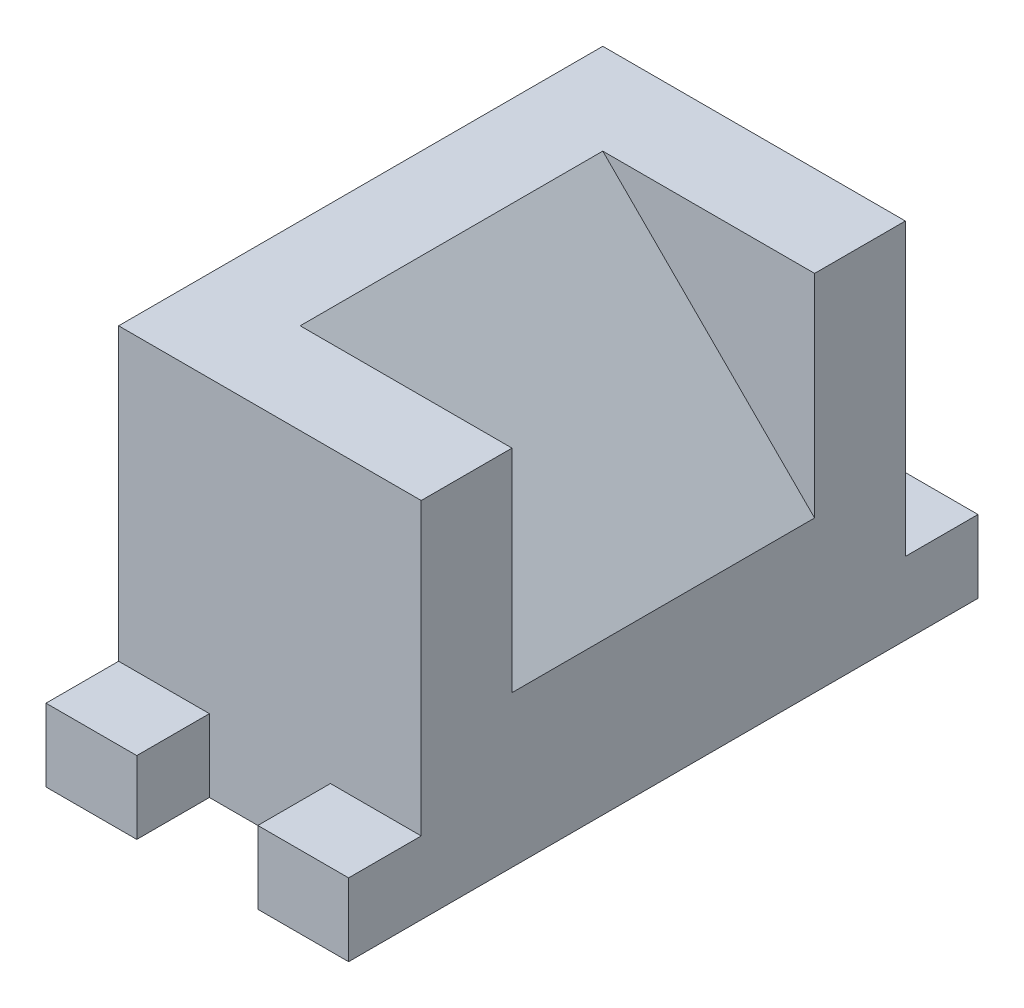
ISO-10303-21;
HEADER;
FILE_DESCRIPTION(('STEP AP214'),'2;1');
FILE_NAME('part.step','',(''),(''),'','','');
FILE_SCHEMA(('AUTOMOTIVE_DESIGN { 1 0 10303 214 1 1 1 1 }'));
ENDSEC;
DATA;
#1=APPLICATION_CONTEXT('core data for automotive mechanical design processes');
#2=APPLICATION_PROTOCOL_DEFINITION('international standard','automotive_design',2000,#1);
#3=PRODUCT_CONTEXT('',#1,'mechanical');
#4=PRODUCT('Part','Part','',(#3));
#5=PRODUCT_RELATED_PRODUCT_CATEGORY('part','',(#4));
#6=PRODUCT_DEFINITION_FORMATION('','',#4);
#7=PRODUCT_DEFINITION_CONTEXT('part definition',#1,'design');
#8=PRODUCT_DEFINITION('design','',#6,#7);
#9=PRODUCT_DEFINITION_SHAPE('','',#8);
#10=(LENGTH_UNIT() NAMED_UNIT(*) SI_UNIT(.MILLI.,.METRE.));
#11=(NAMED_UNIT(*) PLANE_ANGLE_UNIT() SI_UNIT($,.RADIAN.));
#12=(NAMED_UNIT(*) SI_UNIT($,.STERADIAN.) SOLID_ANGLE_UNIT());
#13=UNCERTAINTY_MEASURE_WITH_UNIT(LENGTH_MEASURE(1.E-05),#10,'distance_accuracy_value','');
#14=(GEOMETRIC_REPRESENTATION_CONTEXT(3) GLOBAL_UNCERTAINTY_ASSIGNED_CONTEXT((#13)) GLOBAL_UNIT_ASSIGNED_CONTEXT((#10,
#11,#12)) REPRESENTATION_CONTEXT('',''));
#15=CARTESIAN_POINT('',(0.,0.,0.));
#16=DIRECTION('',(0.,0.,1.));
#17=DIRECTION('',(1.,0.,0.));
#18=AXIS2_PLACEMENT_3D('',#15,#16,#17);
#19=CARTESIAN_POINT('',(-25.,60.,-40.));
#20=DIRECTION('',(0.,0.,1.));
#21=DIRECTION('',(1.,0.,0.));
#22=AXIS2_PLACEMENT_3D('',#19,#20,#21);
#23=PLANE('',#22);
#24=DIRECTION('',(0.,1.,0.));
#25=VECTOR('',#24,1.);
#26=CARTESIAN_POINT('',(10.,0.,-40.));
#27=LINE('',#26,#25);
#28=CARTESIAN_POINT('',(10.,0.,-40.));
#29=VERTEX_POINT('',#28);
#30=CARTESIAN_POINT('',(10.,12.,-40.));
#31=VERTEX_POINT('',#30);
#32=EDGE_CURVE('E186',#29,#31,#27,.T.);
#33=ORIENTED_EDGE('',*,*,#32,.F.);
#34=DIRECTION('',(-1.,0.,0.));
#35=VECTOR('',#34,1.);
#36=CARTESIAN_POINT('',(-25.,0.,-40.));
#37=LINE('',#36,#35);
#38=CARTESIAN_POINT('',(-10.,0.,-40.));
#39=VERTEX_POINT('',#38);
#40=EDGE_CURVE('E297',#29,#39,#37,.T.);
#41=ORIENTED_EDGE('',*,*,#40,.T.);
#42=DIRECTION('',(0.,1.,0.));
#43=VECTOR('',#42,1.);
#44=CARTESIAN_POINT('',(-10.,0.,-40.));
#45=LINE('',#44,#43);
#46=CARTESIAN_POINT('',(-10.,12.,-40.));
#47=VERTEX_POINT('',#46);
#48=EDGE_CURVE('E216',#39,#47,#45,.T.);
#49=ORIENTED_EDGE('',*,*,#48,.T.);
#50=DIRECTION('',(-1.,0.,0.));
#51=VECTOR('',#50,1.);
#52=CARTESIAN_POINT('',(-25.,12.,-40.));
#53=LINE('',#52,#51);
#54=CARTESIAN_POINT('',(-25.,12.,-40.));
#55=VERTEX_POINT('',#54);
#56=EDGE_CURVE('E211',#47,#55,#53,.T.);
#57=ORIENTED_EDGE('',*,*,#56,.T.);
#58=DIRECTION('',(0.,-1.,0.));
#59=VECTOR('',#58,1.);
#60=CARTESIAN_POINT('',(-25.,60.,-40.));
#61=LINE('',#60,#59);
#62=CARTESIAN_POINT('',(-25.,60.,-40.));
#63=VERTEX_POINT('',#62);
#64=EDGE_CURVE('E41',#63,#55,#61,.T.);
#65=ORIENTED_EDGE('',*,*,#64,.F.);
#66=DIRECTION('',(-1.,0.,0.));
#67=VECTOR('',#66,1.);
#68=CARTESIAN_POINT('',(-25.,60.,-40.));
#69=LINE('',#68,#67);
#70=CARTESIAN_POINT('',(25.,60.,-40.));
#71=VERTEX_POINT('',#70);
#72=EDGE_CURVE('E288',#71,#63,#69,.T.);
#73=ORIENTED_EDGE('',*,*,#72,.F.);
#74=DIRECTION('',(0.,-1.,0.));
#75=VECTOR('',#74,1.);
#76=CARTESIAN_POINT('',(25.,60.,-40.));
#77=LINE('',#76,#75);
#78=CARTESIAN_POINT('',(25.,12.,-40.));
#79=VERTEX_POINT('',#78);
#80=EDGE_CURVE('E11',#71,#79,#77,.T.);
#81=ORIENTED_EDGE('',*,*,#80,.T.);
#82=DIRECTION('',(1.,0.,0.));
#83=VECTOR('',#82,1.);
#84=CARTESIAN_POINT('',(25.,12.,-40.));
#85=LINE('',#84,#83);
#86=EDGE_CURVE('E55',#31,#79,#85,.T.);
#87=ORIENTED_EDGE('',*,*,#86,.F.);
#88=EDGE_LOOP('',(#33,#41,#49,#57,#65,#73,#81,#87));
#89=FACE_BOUND('',#88,.T.);
#90=ADVANCED_FACE('F33',(#89),#23,.F.);
#91=CARTESIAN_POINT('',(-25.,60.,40.));
#92=DIRECTION('',(0.,0.,-1.));
#93=DIRECTION('',(-1.,0.,0.));
#94=AXIS2_PLACEMENT_3D('',#91,#92,#93);
#95=PLANE('',#94);
#96=DIRECTION('',(0.,1.,0.));
#97=VECTOR('',#96,1.);
#98=CARTESIAN_POINT('',(10.,0.,40.));
#99=LINE('',#98,#97);
#100=CARTESIAN_POINT('',(10.,0.,40.));
#101=VERTEX_POINT('',#100);
#102=CARTESIAN_POINT('',(10.,12.,40.));
#103=VERTEX_POINT('',#102);
#104=EDGE_CURVE('E241',#101,#103,#99,.T.);
#105=ORIENTED_EDGE('',*,*,#104,.T.);
#106=DIRECTION('',(1.,0.,0.));
#107=VECTOR('',#106,1.);
#108=CARTESIAN_POINT('',(25.,12.,40.));
#109=LINE('',#108,#107);
#110=CARTESIAN_POINT('',(25.,12.,40.));
#111=VERTEX_POINT('',#110);
#112=EDGE_CURVE('E236',#103,#111,#109,.T.);
#113=ORIENTED_EDGE('',*,*,#112,.T.);
#114=DIRECTION('',(0.,-1.,0.));
#115=VECTOR('',#114,1.);
#116=CARTESIAN_POINT('',(25.,60.,40.));
#117=LINE('',#116,#115);
#118=CARTESIAN_POINT('',(25.,60.,40.));
#119=VERTEX_POINT('',#118);
#120=EDGE_CURVE('E295',#119,#111,#117,.T.);
#121=ORIENTED_EDGE('',*,*,#120,.F.);
#122=DIRECTION('',(1.,0.,0.));
#123=VECTOR('',#122,1.);
#124=CARTESIAN_POINT('',(-25.,60.,40.));
#125=LINE('',#124,#123);
#126=CARTESIAN_POINT('',(-25.,60.,40.));
#127=VERTEX_POINT('',#126);
#128=EDGE_CURVE('E293',#127,#119,#125,.T.);
#129=ORIENTED_EDGE('',*,*,#128,.F.);
#130=DIRECTION('',(0.,-1.,0.));
#131=VECTOR('',#130,1.);
#132=CARTESIAN_POINT('',(-25.,60.,40.));
#133=LINE('',#132,#131);
#134=CARTESIAN_POINT('',(-25.,12.,40.));
#135=VERTEX_POINT('',#134);
#136=EDGE_CURVE('E305',#127,#135,#133,.T.);
#137=ORIENTED_EDGE('',*,*,#136,.T.);
#138=DIRECTION('',(-1.,0.,0.));
#139=VECTOR('',#138,1.);
#140=CARTESIAN_POINT('',(-25.,12.,40.));
#141=LINE('',#140,#139);
#142=CARTESIAN_POINT('',(-10.,12.,40.));
#143=VERTEX_POINT('',#142);
#144=EDGE_CURVE('E266',#143,#135,#141,.T.);
#145=ORIENTED_EDGE('',*,*,#144,.F.);
#146=DIRECTION('',(0.,1.,0.));
#147=VECTOR('',#146,1.);
#148=CARTESIAN_POINT('',(-10.,0.,40.));
#149=LINE('',#148,#147);
#150=CARTESIAN_POINT('',(-10.,0.,40.));
#151=VERTEX_POINT('',#150);
#152=EDGE_CURVE('E261',#151,#143,#149,.T.);
#153=ORIENTED_EDGE('',*,*,#152,.F.);
#154=DIRECTION('',(1.,0.,0.));
#155=VECTOR('',#154,1.);
#156=CARTESIAN_POINT('',(-25.,0.,40.));
#157=LINE('',#156,#155);
#158=EDGE_CURVE('E301',#151,#101,#157,.T.);
#159=ORIENTED_EDGE('',*,*,#158,.T.);
#160=EDGE_LOOP('',(#105,#113,#121,#129,#137,#145,#153,#159));
#161=FACE_BOUND('',#160,.T.);
#162=ADVANCED_FACE('F341',(#161),#95,.F.);
#163=CARTESIAN_POINT('',(25.,60.,-40.));
#164=DIRECTION('',(-1.,0.,0.));
#165=DIRECTION('',(0.,0.,1.));
#166=AXIS2_PLACEMENT_3D('',#163,#164,#165);
#167=PLANE('',#166);
#168=DIRECTION('',(0.,0.,-1.));
#169=VECTOR('',#168,1.);
#170=CARTESIAN_POINT('',(25.,60.,-40.));
#171=LINE('',#170,#169);
#172=CARTESIAN_POINT('',(25.,60.,-25.));
#173=VERTEX_POINT('',#172);
#174=EDGE_CURVE('E289',#173,#71,#171,.T.);
#175=ORIENTED_EDGE('',*,*,#174,.F.);
#176=DIRECTION('',(0.,1.,0.));
#177=VECTOR('',#176,1.);
#178=CARTESIAN_POINT('',(25.,25.,-25.));
#179=LINE('',#178,#177);
#180=CARTESIAN_POINT('',(25.,25.,-25.));
#181=VERTEX_POINT('',#180);
#182=EDGE_CURVE('E173',#181,#173,#179,.T.);
#183=ORIENTED_EDGE('',*,*,#182,.F.);
#184=DIRECTION('',(0.,0.,1.));
#185=VECTOR('',#184,1.);
#186=CARTESIAN_POINT('',(25.,25.,-25.));
#187=LINE('',#186,#185);
#188=CARTESIAN_POINT('',(25.,25.,25.));
#189=VERTEX_POINT('',#188);
#190=EDGE_CURVE('E170',#181,#189,#187,.T.);
#191=ORIENTED_EDGE('',*,*,#190,.T.);
#192=DIRECTION('',(0.,1.,0.));
#193=VECTOR('',#192,1.);
#194=CARTESIAN_POINT('',(25.,25.,25.));
#195=LINE('',#194,#193);
#196=CARTESIAN_POINT('',(25.,60.,25.));
#197=VERTEX_POINT('',#196);
#198=EDGE_CURVE('E180',#189,#197,#195,.T.);
#199=ORIENTED_EDGE('',*,*,#198,.T.);
#200=EDGE_CURVE('E286',#119,#197,#171,.T.);
#201=ORIENTED_EDGE('',*,*,#200,.F.);
#202=ORIENTED_EDGE('',*,*,#120,.T.);
#203=DIRECTION('',(0.,0.,-1.));
#204=VECTOR('',#203,1.);
#205=CARTESIAN_POINT('',(25.,12.,52.));
#206=LINE('',#205,#204);
#207=CARTESIAN_POINT('',(25.,12.,52.));
#208=VERTEX_POINT('',#207);
#209=EDGE_CURVE('E258',#208,#111,#206,.T.);
#210=ORIENTED_EDGE('',*,*,#209,.F.);
#211=DIRECTION('',(0.,-1.,0.));
#212=VECTOR('',#211,1.);
#213=CARTESIAN_POINT('',(25.,0.,52.));
#214=LINE('',#213,#212);
#215=CARTESIAN_POINT('',(25.,0.,52.));
#216=VERTEX_POINT('',#215);
#217=EDGE_CURVE('E237',#208,#216,#214,.T.);
#218=ORIENTED_EDGE('',*,*,#217,.T.);
#219=DIRECTION('',(0.,0.,-1.));
#220=VECTOR('',#219,1.);
#221=CARTESIAN_POINT('',(25.,0.,-40.));
#222=LINE('',#221,#220);
#223=CARTESIAN_POINT('',(25.,0.,-52.));
#224=VERTEX_POINT('',#223);
#225=EDGE_CURVE('E285',#216,#224,#222,.T.);
#226=ORIENTED_EDGE('',*,*,#225,.T.);
#227=DIRECTION('',(0.,-1.,0.));
#228=VECTOR('',#227,1.);
#229=CARTESIAN_POINT('',(25.,0.,-52.));
#230=LINE('',#229,#228);
#231=CARTESIAN_POINT('',(25.,12.,-52.));
#232=VERTEX_POINT('',#231);
#233=EDGE_CURVE('E191',#232,#224,#230,.T.);
#234=ORIENTED_EDGE('',*,*,#233,.F.);
#235=DIRECTION('',(0.,0.,1.));
#236=VECTOR('',#235,1.);
#237=CARTESIAN_POINT('',(25.,12.,-52.));
#238=LINE('',#237,#236);
#239=EDGE_CURVE('E200',#232,#79,#238,.T.);
#240=ORIENTED_EDGE('',*,*,#239,.T.);
#241=ORIENTED_EDGE('',*,*,#80,.F.);
#242=EDGE_LOOP('',(#175,#183,#191,#199,#201,#202,#210,#218,#226,#234,#240,#241));
#243=FACE_BOUND('',#242,.T.);
#244=ADVANCED_FACE('F35',(#243),#167,.F.);
#245=CARTESIAN_POINT('',(-25.,60.,-40.));
#246=DIRECTION('',(1.,0.,0.));
#247=DIRECTION('',(0.,0.,-1.));
#248=AXIS2_PLACEMENT_3D('',#245,#246,#247);
#249=PLANE('',#248);
#250=DIRECTION('',(0.,0.,1.));
#251=VECTOR('',#250,1.);
#252=CARTESIAN_POINT('',(-25.,0.,-40.));
#253=LINE('',#252,#251);
#254=CARTESIAN_POINT('',(-25.,0.,-52.));
#255=VERTEX_POINT('',#254);
#256=CARTESIAN_POINT('',(-25.,0.,52.));
#257=VERTEX_POINT('',#256);
#258=EDGE_CURVE('E299',#255,#257,#253,.T.);
#259=ORIENTED_EDGE('',*,*,#258,.T.);
#260=DIRECTION('',(0.,-1.,0.));
#261=VECTOR('',#260,1.);
#262=CARTESIAN_POINT('',(-25.,0.,52.));
#263=LINE('',#262,#261);
#264=CARTESIAN_POINT('',(-25.,12.,52.));
#265=VERTEX_POINT('',#264);
#266=EDGE_CURVE('E262',#265,#257,#263,.T.);
#267=ORIENTED_EDGE('',*,*,#266,.F.);
#268=DIRECTION('',(0.,0.,-1.));
#269=VECTOR('',#268,1.);
#270=CARTESIAN_POINT('',(-25.,12.,52.));
#271=LINE('',#270,#269);
#272=EDGE_CURVE('E272',#265,#135,#271,.T.);
#273=ORIENTED_EDGE('',*,*,#272,.T.);
#274=ORIENTED_EDGE('',*,*,#136,.F.);
#275=DIRECTION('',(0.,0.,1.));
#276=VECTOR('',#275,1.);
#277=CARTESIAN_POINT('',(-25.,60.,-40.));
#278=LINE('',#277,#276);
#279=EDGE_CURVE('E291',#63,#127,#278,.T.);
#280=ORIENTED_EDGE('',*,*,#279,.F.);
#281=ORIENTED_EDGE('',*,*,#64,.T.);
#282=DIRECTION('',(0.,0.,1.));
#283=VECTOR('',#282,1.);
#284=CARTESIAN_POINT('',(-25.,12.,-52.));
#285=LINE('',#284,#283);
#286=CARTESIAN_POINT('',(-25.,12.,-52.));
#287=VERTEX_POINT('',#286);
#288=EDGE_CURVE('E234',#287,#55,#285,.T.);
#289=ORIENTED_EDGE('',*,*,#288,.F.);
#290=DIRECTION('',(0.,-1.,0.));
#291=VECTOR('',#290,1.);
#292=CARTESIAN_POINT('',(-25.,0.,-52.));
#293=LINE('',#292,#291);
#294=EDGE_CURVE('E212',#287,#255,#293,.T.);
#295=ORIENTED_EDGE('',*,*,#294,.T.);
#296=EDGE_LOOP('',(#259,#267,#273,#274,#280,#281,#289,#295));
#297=FACE_BOUND('',#296,.T.);
#298=ADVANCED_FACE('F310',(#297),#249,.F.);
#299=CARTESIAN_POINT('',(0.,60.,0.));
#300=DIRECTION('',(0.,1.,0.));
#301=DIRECTION('',(0.,0.,1.));
#302=AXIS2_PLACEMENT_3D('',#299,#300,#301);
#303=PLANE('',#302);
#304=DIRECTION('',(-1.,0.,0.));
#305=VECTOR('',#304,1.);
#306=CARTESIAN_POINT('',(25.,60.,-25.));
#307=LINE('',#306,#305);
#308=CARTESIAN_POINT('',(-9.99999999999999,60.,-25.));
#309=VERTEX_POINT('',#308);
#310=EDGE_CURVE('E174',#173,#309,#307,.T.);
#311=ORIENTED_EDGE('',*,*,#310,.F.);
#312=ORIENTED_EDGE('',*,*,#174,.T.);
#313=ORIENTED_EDGE('',*,*,#72,.T.);
#314=ORIENTED_EDGE('',*,*,#279,.T.);
#315=ORIENTED_EDGE('',*,*,#128,.T.);
#316=ORIENTED_EDGE('',*,*,#200,.T.);
#317=DIRECTION('',(-1.,0.,0.));
#318=VECTOR('',#317,1.);
#319=CARTESIAN_POINT('',(25.,60.,25.));
#320=LINE('',#319,#318);
#321=CARTESIAN_POINT('',(-9.99999999999999,60.,25.));
#322=VERTEX_POINT('',#321);
#323=EDGE_CURVE('E184',#197,#322,#320,.T.);
#324=ORIENTED_EDGE('',*,*,#323,.T.);
#325=DIRECTION('',(0.,0.,1.));
#326=VECTOR('',#325,1.);
#327=CARTESIAN_POINT('',(-9.99999999999999,60.,-25.));
#328=LINE('',#327,#326);
#329=EDGE_CURVE('E167',#309,#322,#328,.T.);
#330=ORIENTED_EDGE('',*,*,#329,.F.);
#331=EDGE_LOOP('',(#311,#312,#313,#314,#315,#316,#324,#330));
#332=FACE_BOUND('',#331,.T.);
#333=ADVANCED_FACE('F182',(#332),#303,.T.);
#334=CARTESIAN_POINT('',(0.,0.,0.));
#335=DIRECTION('',(0.,1.,0.));
#336=DIRECTION('',(0.,0.,1.));
#337=AXIS2_PLACEMENT_3D('',#334,#335,#336);
#338=PLANE('',#337);
#339=ORIENTED_EDGE('',*,*,#225,.F.);
#340=DIRECTION('',(-1.,0.,0.));
#341=VECTOR('',#340,1.);
#342=CARTESIAN_POINT('',(25.,0.,52.));
#343=LINE('',#342,#341);
#344=CARTESIAN_POINT('',(10.,0.,52.));
#345=VERTEX_POINT('',#344);
#346=EDGE_CURVE('E247',#216,#345,#343,.T.);
#347=ORIENTED_EDGE('',*,*,#346,.T.);
#348=DIRECTION('',(0.,0.,-1.));
#349=VECTOR('',#348,1.);
#350=CARTESIAN_POINT('',(10.,0.,52.));
#351=LINE('',#350,#349);
#352=EDGE_CURVE('E250',#345,#101,#351,.T.);
#353=ORIENTED_EDGE('',*,*,#352,.T.);
#354=ORIENTED_EDGE('',*,*,#158,.F.);
#355=DIRECTION('',(0.,0.,-1.));
#356=VECTOR('',#355,1.);
#357=CARTESIAN_POINT('',(-10.,0.,52.));
#358=LINE('',#357,#356);
#359=CARTESIAN_POINT('',(-10.,0.,52.));
#360=VERTEX_POINT('',#359);
#361=EDGE_CURVE('E282',#360,#151,#358,.T.);
#362=ORIENTED_EDGE('',*,*,#361,.F.);
#363=DIRECTION('',(1.,0.,0.));
#364=VECTOR('',#363,1.);
#365=CARTESIAN_POINT('',(-25.,0.,52.));
#366=LINE('',#365,#364);
#367=EDGE_CURVE('E265',#257,#360,#366,.T.);
#368=ORIENTED_EDGE('',*,*,#367,.F.);
#369=ORIENTED_EDGE('',*,*,#258,.F.);
#370=DIRECTION('',(1.,0.,0.));
#371=VECTOR('',#370,1.);
#372=CARTESIAN_POINT('',(-25.,0.,-52.));
#373=LINE('',#372,#371);
#374=CARTESIAN_POINT('',(-10.,0.,-52.));
#375=VERTEX_POINT('',#374);
#376=EDGE_CURVE('E222',#255,#375,#373,.T.);
#377=ORIENTED_EDGE('',*,*,#376,.T.);
#378=DIRECTION('',(0.,0.,1.));
#379=VECTOR('',#378,1.);
#380=CARTESIAN_POINT('',(-10.,0.,-52.));
#381=LINE('',#380,#379);
#382=EDGE_CURVE('E225',#375,#39,#381,.T.);
#383=ORIENTED_EDGE('',*,*,#382,.T.);
#384=ORIENTED_EDGE('',*,*,#40,.F.);
#385=DIRECTION('',(0.,0.,1.));
#386=VECTOR('',#385,1.);
#387=CARTESIAN_POINT('',(10.,0.,-52.));
#388=LINE('',#387,#386);
#389=CARTESIAN_POINT('',(10.,0.,-52.));
#390=VERTEX_POINT('',#389);
#391=EDGE_CURVE('E208',#390,#29,#388,.T.);
#392=ORIENTED_EDGE('',*,*,#391,.F.);
#393=DIRECTION('',(-1.,0.,0.));
#394=VECTOR('',#393,1.);
#395=CARTESIAN_POINT('',(25.,0.,-52.));
#396=LINE('',#395,#394);
#397=EDGE_CURVE('E194',#224,#390,#396,.T.);
#398=ORIENTED_EDGE('',*,*,#397,.F.);
#399=EDGE_LOOP('',(#339,#347,#353,#354,#362,#368,#369,#377,#383,#384,#392,#398));
#400=FACE_BOUND('',#399,.T.);
#401=ADVANCED_FACE('F327',(#400),#338,.F.);
#402=CARTESIAN_POINT('',(-10.,0.,52.));
#403=DIRECTION('',(-1.,0.,0.));
#404=DIRECTION('',(0.,0.,1.));
#405=AXIS2_PLACEMENT_3D('',#402,#403,#404);
#406=PLANE('',#405);
#407=ORIENTED_EDGE('',*,*,#152,.T.);
#408=DIRECTION('',(0.,0.,-1.));
#409=VECTOR('',#408,1.);
#410=CARTESIAN_POINT('',(-10.,12.,52.));
#411=LINE('',#410,#409);
#412=CARTESIAN_POINT('',(-10.,12.,52.));
#413=VERTEX_POINT('',#412);
#414=EDGE_CURVE('E279',#413,#143,#411,.T.);
#415=ORIENTED_EDGE('',*,*,#414,.F.);
#416=DIRECTION('',(0.,1.,0.));
#417=VECTOR('',#416,1.);
#418=CARTESIAN_POINT('',(-10.,0.,52.));
#419=LINE('',#418,#417);
#420=EDGE_CURVE('E268',#360,#413,#419,.T.);
#421=ORIENTED_EDGE('',*,*,#420,.F.);
#422=ORIENTED_EDGE('',*,*,#361,.T.);
#423=EDGE_LOOP('',(#407,#415,#421,#422));
#424=FACE_BOUND('',#423,.T.);
#425=ADVANCED_FACE('F345',(#424),#406,.F.);
#426=CARTESIAN_POINT('',(-25.,12.,52.));
#427=DIRECTION('',(0.,-1.,0.));
#428=DIRECTION('',(0.,0.,-1.));
#429=AXIS2_PLACEMENT_3D('',#426,#427,#428);
#430=PLANE('',#429);
#431=ORIENTED_EDGE('',*,*,#144,.T.);
#432=ORIENTED_EDGE('',*,*,#272,.F.);
#433=DIRECTION('',(-1.,0.,0.));
#434=VECTOR('',#433,1.);
#435=CARTESIAN_POINT('',(-25.,12.,52.));
#436=LINE('',#435,#434);
#437=EDGE_CURVE('E270',#413,#265,#436,.T.);
#438=ORIENTED_EDGE('',*,*,#437,.F.);
#439=ORIENTED_EDGE('',*,*,#414,.T.);
#440=EDGE_LOOP('',(#431,#432,#438,#439));
#441=FACE_BOUND('',#440,.T.);
#442=ADVANCED_FACE('F339',(#441),#430,.F.);
#443=CARTESIAN_POINT('',(0.,0.,52.));
#444=DIRECTION('',(0.,0.,-1.));
#445=DIRECTION('',(-1.,0.,0.));
#446=AXIS2_PLACEMENT_3D('',#443,#444,#445);
#447=PLANE('',#446);
#448=ORIENTED_EDGE('',*,*,#266,.T.);
#449=ORIENTED_EDGE('',*,*,#367,.T.);
#450=ORIENTED_EDGE('',*,*,#420,.T.);
#451=ORIENTED_EDGE('',*,*,#437,.T.);
#452=EDGE_LOOP('',(#448,#449,#450,#451));
#453=FACE_BOUND('',#452,.T.);
#454=ADVANCED_FACE('F334',(#453),#447,.F.);
#455=CARTESIAN_POINT('',(25.,12.,52.));
#456=DIRECTION('',(0.,1.,0.));
#457=DIRECTION('',(0.,0.,1.));
#458=AXIS2_PLACEMENT_3D('',#455,#456,#457);
#459=PLANE('',#458);
#460=ORIENTED_EDGE('',*,*,#112,.F.);
#461=DIRECTION('',(0.,0.,-1.));
#462=VECTOR('',#461,1.);
#463=CARTESIAN_POINT('',(10.,12.,52.));
#464=LINE('',#463,#462);
#465=CARTESIAN_POINT('',(10.,12.,52.));
#466=VERTEX_POINT('',#465);
#467=EDGE_CURVE('E255',#466,#103,#464,.T.);
#468=ORIENTED_EDGE('',*,*,#467,.F.);
#469=DIRECTION('',(1.,0.,0.));
#470=VECTOR('',#469,1.);
#471=CARTESIAN_POINT('',(25.,12.,52.));
#472=LINE('',#471,#470);
#473=EDGE_CURVE('E240',#466,#208,#472,.T.);
#474=ORIENTED_EDGE('',*,*,#473,.T.);
#475=ORIENTED_EDGE('',*,*,#209,.T.);
#476=EDGE_LOOP('',(#460,#468,#474,#475));
#477=FACE_BOUND('',#476,.T.);
#478=ADVANCED_FACE('F354',(#477),#459,.T.);
#479=CARTESIAN_POINT('',(10.,0.,52.));
#480=DIRECTION('',(-1.,0.,0.));
#481=DIRECTION('',(0.,0.,1.));
#482=AXIS2_PLACEMENT_3D('',#479,#480,#481);
#483=PLANE('',#482);
#484=ORIENTED_EDGE('',*,*,#104,.F.);
#485=ORIENTED_EDGE('',*,*,#352,.F.);
#486=DIRECTION('',(0.,1.,0.));
#487=VECTOR('',#486,1.);
#488=CARTESIAN_POINT('',(10.,0.,52.));
#489=LINE('',#488,#487);
#490=EDGE_CURVE('E244',#345,#466,#489,.T.);
#491=ORIENTED_EDGE('',*,*,#490,.T.);
#492=ORIENTED_EDGE('',*,*,#467,.T.);
#493=EDGE_LOOP('',(#484,#485,#491,#492));
#494=FACE_BOUND('',#493,.T.);
#495=ADVANCED_FACE('F350',(#494),#483,.T.);
#496=CARTESIAN_POINT('',(0.,0.,52.));
#497=DIRECTION('',(0.,0.,-1.));
#498=DIRECTION('',(1.,0.,0.));
#499=AXIS2_PLACEMENT_3D('',#496,#497,#498);
#500=PLANE('',#499);
#501=ORIENTED_EDGE('',*,*,#217,.F.);
#502=ORIENTED_EDGE('',*,*,#473,.F.);
#503=ORIENTED_EDGE('',*,*,#490,.F.);
#504=ORIENTED_EDGE('',*,*,#346,.F.);
#505=EDGE_LOOP('',(#501,#502,#503,#504));
#506=FACE_BOUND('',#505,.T.);
#507=ADVANCED_FACE('F360',(#506),#500,.F.);
#508=CARTESIAN_POINT('',(-25.,12.,-52.));
#509=DIRECTION('',(0.,1.,0.));
#510=DIRECTION('',(0.,0.,1.));
#511=AXIS2_PLACEMENT_3D('',#508,#509,#510);
#512=PLANE('',#511);
#513=ORIENTED_EDGE('',*,*,#56,.F.);
#514=DIRECTION('',(0.,0.,1.));
#515=VECTOR('',#514,1.);
#516=CARTESIAN_POINT('',(-10.,12.,-52.));
#517=LINE('',#516,#515);
#518=CARTESIAN_POINT('',(-10.,12.,-52.));
#519=VERTEX_POINT('',#518);
#520=EDGE_CURVE('E232',#519,#47,#517,.T.);
#521=ORIENTED_EDGE('',*,*,#520,.F.);
#522=DIRECTION('',(-1.,0.,0.));
#523=VECTOR('',#522,1.);
#524=CARTESIAN_POINT('',(-25.,12.,-52.));
#525=LINE('',#524,#523);
#526=EDGE_CURVE('E215',#519,#287,#525,.T.);
#527=ORIENTED_EDGE('',*,*,#526,.T.);
#528=ORIENTED_EDGE('',*,*,#288,.T.);
#529=EDGE_LOOP('',(#513,#521,#527,#528));
#530=FACE_BOUND('',#529,.T.);
#531=ADVANCED_FACE('F318',(#530),#512,.T.);
#532=CARTESIAN_POINT('',(-10.,0.,-52.));
#533=DIRECTION('',(1.,0.,0.));
#534=DIRECTION('',(0.,0.,-1.));
#535=AXIS2_PLACEMENT_3D('',#532,#533,#534);
#536=PLANE('',#535);
#537=ORIENTED_EDGE('',*,*,#48,.F.);
#538=ORIENTED_EDGE('',*,*,#382,.F.);
#539=DIRECTION('',(0.,1.,0.));
#540=VECTOR('',#539,1.);
#541=CARTESIAN_POINT('',(-10.,0.,-52.));
#542=LINE('',#541,#540);
#543=EDGE_CURVE('E219',#375,#519,#542,.T.);
#544=ORIENTED_EDGE('',*,*,#543,.T.);
#545=ORIENTED_EDGE('',*,*,#520,.T.);
#546=EDGE_LOOP('',(#537,#538,#544,#545));
#547=FACE_BOUND('',#546,.T.);
#548=ADVANCED_FACE('F325',(#547),#536,.T.);
#549=CARTESIAN_POINT('',(0.,0.,-52.));
#550=DIRECTION('',(0.,0.,1.));
#551=DIRECTION('',(-1.,0.,0.));
#552=AXIS2_PLACEMENT_3D('',#549,#550,#551);
#553=PLANE('',#552);
#554=ORIENTED_EDGE('',*,*,#294,.F.);
#555=ORIENTED_EDGE('',*,*,#526,.F.);
#556=ORIENTED_EDGE('',*,*,#543,.F.);
#557=ORIENTED_EDGE('',*,*,#376,.F.);
#558=EDGE_LOOP('',(#554,#555,#556,#557));
#559=FACE_BOUND('',#558,.T.);
#560=ADVANCED_FACE('F322',(#559),#553,.F.);
#561=CARTESIAN_POINT('',(10.,0.,-52.));
#562=DIRECTION('',(1.,0.,0.));
#563=DIRECTION('',(0.,0.,-1.));
#564=AXIS2_PLACEMENT_3D('',#561,#562,#563);
#565=PLANE('',#564);
#566=ORIENTED_EDGE('',*,*,#32,.T.);
#567=DIRECTION('',(0.,0.,1.));
#568=VECTOR('',#567,1.);
#569=CARTESIAN_POINT('',(10.,12.,-52.));
#570=LINE('',#569,#568);
#571=CARTESIAN_POINT('',(10.,12.,-52.));
#572=VERTEX_POINT('',#571);
#573=EDGE_CURVE('E205',#572,#31,#570,.T.);
#574=ORIENTED_EDGE('',*,*,#573,.F.);
#575=DIRECTION('',(0.,1.,0.));
#576=VECTOR('',#575,1.);
#577=CARTESIAN_POINT('',(10.,0.,-52.));
#578=LINE('',#577,#576);
#579=EDGE_CURVE('E196',#390,#572,#578,.T.);
#580=ORIENTED_EDGE('',*,*,#579,.F.);
#581=ORIENTED_EDGE('',*,*,#391,.T.);
#582=EDGE_LOOP('',(#566,#574,#580,#581));
#583=FACE_BOUND('',#582,.T.);
#584=ADVANCED_FACE('F372',(#583),#565,.F.);
#585=CARTESIAN_POINT('',(25.,12.,-52.));
#586=DIRECTION('',(0.,-1.,0.));
#587=DIRECTION('',(0.,0.,-1.));
#588=AXIS2_PLACEMENT_3D('',#585,#586,#587);
#589=PLANE('',#588);
#590=ORIENTED_EDGE('',*,*,#86,.T.);
#591=ORIENTED_EDGE('',*,*,#239,.F.);
#592=DIRECTION('',(1.,0.,0.));
#593=VECTOR('',#592,1.);
#594=CARTESIAN_POINT('',(25.,12.,-52.));
#595=LINE('',#594,#593);
#596=EDGE_CURVE('E198',#572,#232,#595,.T.);
#597=ORIENTED_EDGE('',*,*,#596,.F.);
#598=ORIENTED_EDGE('',*,*,#573,.T.);
#599=EDGE_LOOP('',(#590,#591,#597,#598));
#600=FACE_BOUND('',#599,.T.);
#601=ADVANCED_FACE('F370',(#600),#589,.F.);
#602=CARTESIAN_POINT('',(0.,0.,-52.));
#603=DIRECTION('',(0.,0.,1.));
#604=DIRECTION('',(1.,0.,0.));
#605=AXIS2_PLACEMENT_3D('',#602,#603,#604);
#606=PLANE('',#605);
#607=ORIENTED_EDGE('',*,*,#233,.T.);
#608=ORIENTED_EDGE('',*,*,#397,.T.);
#609=ORIENTED_EDGE('',*,*,#579,.T.);
#610=ORIENTED_EDGE('',*,*,#596,.T.);
#611=EDGE_LOOP('',(#607,#608,#609,#610));
#612=FACE_BOUND('',#611,.T.);
#613=ADVANCED_FACE('F365',(#612),#606,.F.);
#614=CARTESIAN_POINT('',(-9.99999999999999,60.,-25.));
#615=DIRECTION('',(-0.707106781186548,-0.707106781186548,0.));
#616=DIRECTION('',(0.707106781186548,-0.707106781186548,0.));
#617=AXIS2_PLACEMENT_3D('',#614,#615,#616);
#618=PLANE('',#617);
#619=DIRECTION('',(0.707106781186548,-0.707106781186548,0.));
#620=VECTOR('',#619,1.);
#621=CARTESIAN_POINT('',(-9.99999999999999,60.,25.));
#622=LINE('',#621,#620);
#623=EDGE_CURVE('E48',#322,#189,#622,.T.);
#624=ORIENTED_EDGE('',*,*,#623,.T.);
#625=ORIENTED_EDGE('',*,*,#190,.F.);
#626=DIRECTION('',(0.707106781186548,-0.707106781186548,0.));
#627=VECTOR('',#626,1.);
#628=CARTESIAN_POINT('',(-9.99999999999999,60.,-25.));
#629=LINE('',#628,#627);
#630=EDGE_CURVE('E163',#309,#181,#629,.T.);
#631=ORIENTED_EDGE('',*,*,#630,.F.);
#632=ORIENTED_EDGE('',*,*,#329,.T.);
#633=EDGE_LOOP('',(#624,#625,#631,#632));
#634=FACE_BOUND('',#633,.T.);
#635=ADVANCED_FACE('F165',(#634),#618,.F.);
#636=CARTESIAN_POINT('',(0.,0.,-25.));
#637=DIRECTION('',(0.,0.,-1.));
#638=DIRECTION('',(-1.,0.,0.));
#639=AXIS2_PLACEMENT_3D('',#636,#637,#638);
#640=PLANE('',#639);
#641=ORIENTED_EDGE('',*,*,#310,.T.);
#642=ORIENTED_EDGE('',*,*,#630,.T.);
#643=ORIENTED_EDGE('',*,*,#182,.T.);
#644=EDGE_LOOP('',(#641,#642,#643));
#645=FACE_BOUND('',#644,.T.);
#646=ADVANCED_FACE('F177',(#645),#640,.F.);
#647=CARTESIAN_POINT('',(0.,0.,25.));
#648=DIRECTION('',(0.,0.,-1.));
#649=DIRECTION('',(-1.,0.,0.));
#650=AXIS2_PLACEMENT_3D('',#647,#648,#649);
#651=PLANE('',#650);
#652=ORIENTED_EDGE('',*,*,#323,.F.);
#653=ORIENTED_EDGE('',*,*,#198,.F.);
#654=ORIENTED_EDGE('',*,*,#623,.F.);
#655=EDGE_LOOP('',(#652,#653,#654));
#656=FACE_BOUND('',#655,.T.);
#657=ADVANCED_FACE('F469',(#656),#651,.T.);
#658=CLOSED_SHELL('',(#90,#162,#244,#298,#333,#401,#425,#442,#454,#478,#495,#507,#531,#548,#560,
#584,#601,#613,#635,#646,#657));
#659=MANIFOLD_SOLID_BREP('B2',#658);
#660=ADVANCED_BREP_SHAPE_REPRESENTATION('',(#18,#659),#14);
#661=SHAPE_DEFINITION_REPRESENTATION(#9,#660);
ENDSEC;
END-ISO-10303-21;
